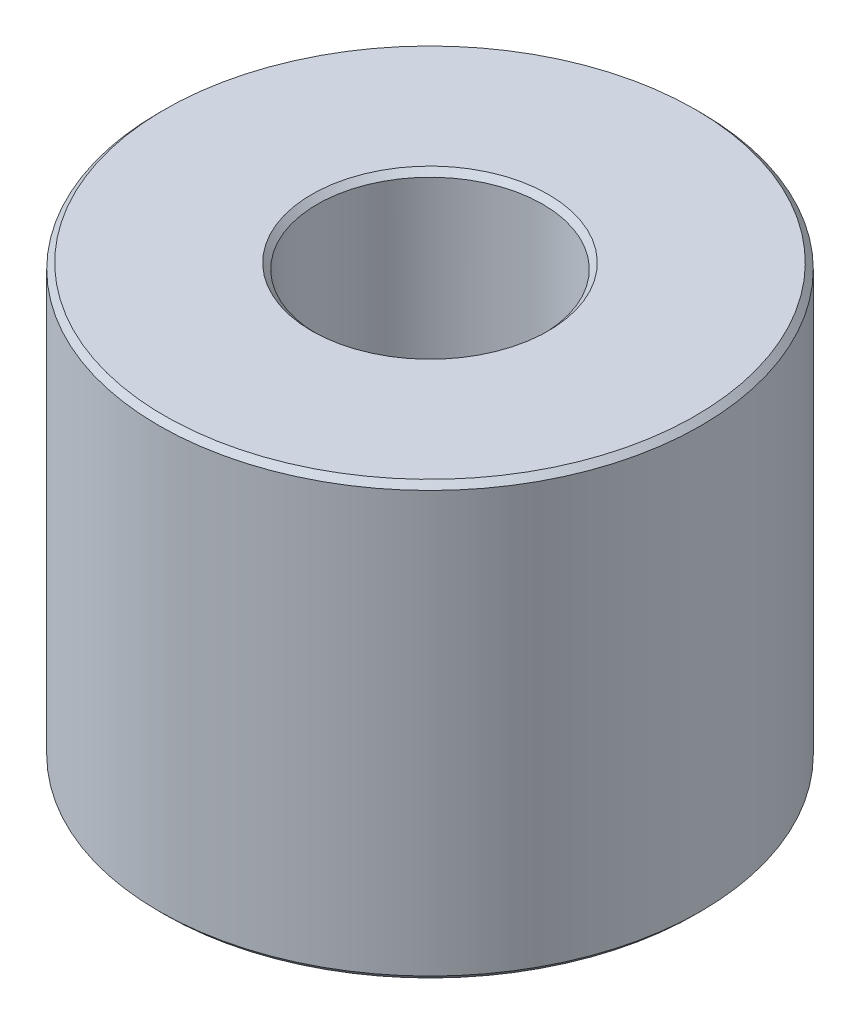
ISO-10303-21;
HEADER;
FILE_DESCRIPTION(('STEP AP214'),'2;1');
FILE_NAME('part.step','',(''),(''),'','','');
FILE_SCHEMA(('AUTOMOTIVE_DESIGN { 1 0 10303 214 1 1 1 1 }'));
ENDSEC;
DATA;
#1=APPLICATION_CONTEXT('core data for automotive mechanical design processes');
#2=APPLICATION_PROTOCOL_DEFINITION('international standard','automotive_design',2000,#1);
#3=PRODUCT_CONTEXT('',#1,'mechanical');
#4=PRODUCT('Part','Part','',(#3));
#5=PRODUCT_RELATED_PRODUCT_CATEGORY('part','',(#4));
#6=PRODUCT_DEFINITION_FORMATION('','',#4);
#7=PRODUCT_DEFINITION_CONTEXT('part definition',#1,'design');
#8=PRODUCT_DEFINITION('design','',#6,#7);
#9=PRODUCT_DEFINITION_SHAPE('','',#8);
#10=(LENGTH_UNIT() NAMED_UNIT(*) SI_UNIT(.MILLI.,.METRE.));
#11=(NAMED_UNIT(*) PLANE_ANGLE_UNIT() SI_UNIT($,.RADIAN.));
#12=(NAMED_UNIT(*) SI_UNIT($,.STERADIAN.) SOLID_ANGLE_UNIT());
#13=UNCERTAINTY_MEASURE_WITH_UNIT(LENGTH_MEASURE(1.E-05),#10,'distance_accuracy_value','');
#14=(GEOMETRIC_REPRESENTATION_CONTEXT(3) GLOBAL_UNCERTAINTY_ASSIGNED_CONTEXT((#13)) GLOBAL_UNIT_ASSIGNED_CONTEXT((#10,
#11,#12)) REPRESENTATION_CONTEXT('',''));
#15=CARTESIAN_POINT('',(0.,0.,0.));
#16=DIRECTION('',(0.,0.,1.));
#17=DIRECTION('',(1.,0.,0.));
#18=AXIS2_PLACEMENT_3D('',#15,#16,#17);
#19=CARTESIAN_POINT('',(0.,71.7030483440527,0.));
#20=DIRECTION('',(0.,-1.,0.));
#21=DIRECTION('',(0.,0.,-1.));
#22=AXIS2_PLACEMENT_3D('',#19,#20,#21);
#23=CYLINDRICAL_SURFACE('',#22,45.);
#24=CARTESIAN_POINT('',(0.,0.938488548072991,0.));
#25=DIRECTION('',(0.,1.,0.));
#26=DIRECTION('',(0.,0.,1.));
#27=AXIS2_PLACEMENT_3D('',#24,#25,#26);
#28=CIRCLE('',#27,45.);
#29=CARTESIAN_POINT('',(0.,0.938488548072991,45.));
#30=VERTEX_POINT('',#29);
#31=EDGE_CURVE('E10',#30,#30,#28,.T.);
#32=ORIENTED_EDGE('',*,*,#31,.T.);
#33=EDGE_LOOP('',(#32));
#34=FACE_BOUND('',#33,.T.);
#35=CARTESIAN_POINT('',(0.,70.7645597959797,0.));
#36=DIRECTION('',(0.,1.,0.));
#37=DIRECTION('',(0.,0.,1.));
#38=AXIS2_PLACEMENT_3D('',#35,#36,#37);
#39=CIRCLE('',#38,45.);
#40=CARTESIAN_POINT('',(0.,70.7645597959797,-45.));
#41=VERTEX_POINT('',#40);
#42=EDGE_CURVE('E50',#41,#41,#39,.F.);
#43=ORIENTED_EDGE('',*,*,#42,.T.);
#44=EDGE_LOOP('',(#43));
#45=FACE_BOUND('',#44,.T.);
#46=ADVANCED_FACE('F39',(#34,#45),#23,.T.);
#47=CARTESIAN_POINT('',(0.,71.7030483440527,0.));
#48=DIRECTION('',(0.,1.,0.));
#49=DIRECTION('',(0.,0.,1.));
#50=AXIS2_PLACEMENT_3D('',#47,#48,#49);
#51=PLANE('',#50);
#52=CARTESIAN_POINT('',(0.,71.7030483440527,0.));
#53=DIRECTION('',(0.,1.,0.));
#54=DIRECTION('',(0.,0.,1.));
#55=AXIS2_PLACEMENT_3D('',#52,#53,#54);
#56=CIRCLE('',#55,19.6437963944167);
#57=CARTESIAN_POINT('',(0.,71.7030483440527,19.6437963944167));
#58=VERTEX_POINT('',#57);
#59=EDGE_CURVE('E58',#58,#58,#56,.F.);
#60=ORIENTED_EDGE('',*,*,#59,.T.);
#61=EDGE_LOOP('',(#60));
#62=FACE_BOUND('',#61,.T.);
#63=CARTESIAN_POINT('',(0.,71.7030483440527,0.));
#64=DIRECTION('',(0.,1.,0.));
#65=DIRECTION('',(0.,0.,1.));
#66=AXIS2_PLACEMENT_3D('',#63,#64,#65);
#67=CIRCLE('',#66,44.061511451927);
#68=CARTESIAN_POINT('',(0.,71.7030483440527,-44.061511451927));
#69=VERTEX_POINT('',#68);
#70=EDGE_CURVE('E61',#69,#69,#67,.T.);
#71=ORIENTED_EDGE('',*,*,#70,.T.);
#72=EDGE_LOOP('',(#71));
#73=FACE_BOUND('',#72,.T.);
#74=ADVANCED_FACE('F88',(#62,#73),#51,.T.);
#75=CARTESIAN_POINT('',(0.,0.,0.));
#76=DIRECTION('',(0.,1.,0.));
#77=DIRECTION('',(0.,0.,1.));
#78=AXIS2_PLACEMENT_3D('',#75,#76,#77);
#79=PLANE('',#78);
#80=CARTESIAN_POINT('',(0.,0.,0.));
#81=DIRECTION('',(0.,1.,0.));
#82=DIRECTION('',(0.,0.,1.));
#83=AXIS2_PLACEMENT_3D('',#80,#81,#82);
#84=CIRCLE('',#83,19.6437963944167);
#85=CARTESIAN_POINT('',(0.,0.,-19.6437963944167));
#86=VERTEX_POINT('',#85);
#87=EDGE_CURVE('E51',#86,#86,#84,.T.);
#88=ORIENTED_EDGE('',*,*,#87,.T.);
#89=EDGE_LOOP('',(#88));
#90=FACE_BOUND('',#89,.T.);
#91=CARTESIAN_POINT('',(0.,0.,0.));
#92=DIRECTION('',(0.,1.,0.));
#93=DIRECTION('',(0.,0.,1.));
#94=AXIS2_PLACEMENT_3D('',#91,#92,#93);
#95=CIRCLE('',#94,44.061511451927);
#96=CARTESIAN_POINT('',(0.,0.,44.061511451927));
#97=VERTEX_POINT('',#96);
#98=EDGE_CURVE('E54',#97,#97,#95,.F.);
#99=ORIENTED_EDGE('',*,*,#98,.T.);
#100=EDGE_LOOP('',(#99));
#101=FACE_BOUND('',#100,.T.);
#102=ADVANCED_FACE('F83',(#90,#101),#79,.F.);
#103=CARTESIAN_POINT('',(0.,71.7030483440527,0.));
#104=DIRECTION('',(0.,-1.,0.));
#105=DIRECTION('',(0.,0.,-1.));
#106=AXIS2_PLACEMENT_3D('',#103,#104,#105);
#107=CYLINDRICAL_SURFACE('',#106,18.7053078463437);
#108=CARTESIAN_POINT('',(0.,70.7645597959796,0.));
#109=DIRECTION('',(0.,1.,0.));
#110=DIRECTION('',(0.,0.,1.));
#111=AXIS2_PLACEMENT_3D('',#108,#109,#110);
#112=CIRCLE('',#111,18.7053078463437);
#113=CARTESIAN_POINT('',(0.,70.7645597959796,18.7053078463437));
#114=VERTEX_POINT('',#113);
#115=EDGE_CURVE('E67',#114,#114,#112,.T.);
#116=ORIENTED_EDGE('',*,*,#115,.T.);
#117=EDGE_LOOP('',(#116));
#118=FACE_BOUND('',#117,.T.);
#119=CARTESIAN_POINT('',(0.,0.938488548073005,0.));
#120=DIRECTION('',(0.,1.,0.));
#121=DIRECTION('',(0.,0.,1.));
#122=AXIS2_PLACEMENT_3D('',#119,#120,#121);
#123=CIRCLE('',#122,18.7053078463437);
#124=CARTESIAN_POINT('',(0.,0.938488548073005,-18.7053078463437));
#125=VERTEX_POINT('',#124);
#126=EDGE_CURVE('E69',#125,#125,#123,.F.);
#127=ORIENTED_EDGE('',*,*,#126,.T.);
#128=EDGE_LOOP('',(#127));
#129=FACE_BOUND('',#128,.T.);
#130=ADVANCED_FACE('F71',(#118,#129),#107,.F.);
#131=CARTESIAN_POINT('',(0.,70.7645597959796,0.));
#132=DIRECTION('',(0.,1.,0.));
#133=DIRECTION('',(0.,0.,1.));
#134=AXIS2_PLACEMENT_3D('',#131,#132,#133);
#135=CONICAL_SURFACE('',#134,18.7053078463437,0.785398163397448);
#136=ORIENTED_EDGE('',*,*,#59,.F.);
#137=EDGE_LOOP('',(#136));
#138=FACE_BOUND('',#137,.T.);
#139=ORIENTED_EDGE('',*,*,#115,.F.);
#140=EDGE_LOOP('',(#139));
#141=FACE_BOUND('',#140,.T.);
#142=ADVANCED_FACE('F77',(#138,#141),#135,.F.);
#143=CARTESIAN_POINT('',(0.,0.,0.));
#144=DIRECTION('',(0.,-1.,0.));
#145=DIRECTION('',(0.,0.,-1.));
#146=AXIS2_PLACEMENT_3D('',#143,#144,#145);
#147=CONICAL_SURFACE('',#146,19.6437963944167,0.785398163397441);
#148=CARTESIAN_POINT('',(0.,0.938488548073005,-18.7053078463437));
#149=CARTESIAN_POINT('',(0.,0.928712625697244,-18.7150837687194));
#150=CARTESIAN_POINT('',(0.,0.918936703321484,-18.7248596910952));
#151=CARTESIAN_POINT('',(0.,0.899384858569963,-18.7444115358467));
#152=CARTESIAN_POINT('',(0.,0.889608936194202,-18.7541874582225));
#153=CARTESIAN_POINT('',(0.,0.870057091442682,-18.773739302974));
#154=CARTESIAN_POINT('',(0.,0.860281169066921,-18.7835152253498));
#155=CARTESIAN_POINT('',(0.,0.8407293243154,-18.8030670701013));
#156=CARTESIAN_POINT('',(0.,0.83095340193964,-18.812842992477));
#157=CARTESIAN_POINT('',(0.,0.811401557188119,-18.8323948372286));
#158=CARTESIAN_POINT('',(0.,0.801625634812358,-18.8421707596043));
#159=CARTESIAN_POINT('',(0.,0.782073790060837,-18.8617226043558));
#160=CARTESIAN_POINT('',(0.,0.772297867685077,-18.8714985267316));
#161=CARTESIAN_POINT('',(0.,0.752746022933556,-18.8910503714831));
#162=CARTESIAN_POINT('',(0.,0.742970100557795,-18.9008262938589));
#163=CARTESIAN_POINT('',(0.,0.723418255806275,-18.9203781386104));
#164=CARTESIAN_POINT('',(0.,0.713642333430514,-18.9301540609862));
#165=CARTESIAN_POINT('',(0.,0.694090488678993,-18.9497059057377));
#166=CARTESIAN_POINT('',(0.,0.684314566303233,-18.9594818281135));
#167=CARTESIAN_POINT('',(0.,0.664762721551712,-18.979033672865));
#168=CARTESIAN_POINT('',(0.,0.654986799175951,-18.9888095952407));
#169=CARTESIAN_POINT('',(0.,0.63543495442443,-19.0083614399922));
#170=CARTESIAN_POINT('',(0.,0.62565903204867,-19.018137362368));
#171=CARTESIAN_POINT('',(0.,0.606107187297149,-19.0376892071195));
#172=CARTESIAN_POINT('',(0.,0.596331264921388,-19.0474651294953));
#173=CARTESIAN_POINT('',(0.,0.576779420169867,-19.0670169742468));
#174=CARTESIAN_POINT('',(0.,0.567003497794107,-19.0767928966226));
#175=CARTESIAN_POINT('',(0.,0.547451653042586,-19.0963447413741));
#176=CARTESIAN_POINT('',(0.,0.537675730666826,-19.1061206637499));
#177=CARTESIAN_POINT('',(0.,0.518123885915305,-19.1256725085014));
#178=CARTESIAN_POINT('',(0.,0.508347963539544,-19.1354484308771));
#179=CARTESIAN_POINT('',(0.,0.488796118788023,-19.1550002756287));
#180=CARTESIAN_POINT('',(0.,0.479020196412263,-19.1647761980044));
#181=CARTESIAN_POINT('',(0.,0.459468351660742,-19.1843280427559));
#182=CARTESIAN_POINT('',(0.,0.449692429284981,-19.1941039651317));
#183=CARTESIAN_POINT('',(0.,0.43014058453346,-19.2136558098832));
#184=CARTESIAN_POINT('',(0.,0.4203646621577,-19.223431732259));
#185=CARTESIAN_POINT('',(0.,0.400812817406179,-19.2429835770105));
#186=CARTESIAN_POINT('',(0.,0.391036895030419,-19.2527594993863));
#187=CARTESIAN_POINT('',(0.,0.371485050278898,-19.2723113441378));
#188=CARTESIAN_POINT('',(0.,0.361709127903137,-19.2820872665135));
#189=CARTESIAN_POINT('',(0.,0.342157283151616,-19.3016391112651));
#190=CARTESIAN_POINT('',(0.,0.332381360775856,-19.3114150336408));
#191=CARTESIAN_POINT('',(0.,0.312829516024335,-19.3309668783923));
#192=CARTESIAN_POINT('',(0.,0.303053593648574,-19.3407428007681));
#193=CARTESIAN_POINT('',(0.,0.283501748897053,-19.3602946455196));
#194=CARTESIAN_POINT('',(0.,0.273725826521293,-19.3700705678954));
#195=CARTESIAN_POINT('',(0.,0.254173981769772,-19.3896224126469));
#196=CARTESIAN_POINT('',(0.,0.244398059394012,-19.3993983350227));
#197=CARTESIAN_POINT('',(0.,0.224846214642491,-19.4189501797742));
#198=CARTESIAN_POINT('',(0.,0.21507029226673,-19.4287261021499));
#199=CARTESIAN_POINT('',(0.,0.195518447515209,-19.4482779469015));
#200=CARTESIAN_POINT('',(0.,0.185742525139449,-19.4580538692772));
#201=CARTESIAN_POINT('',(0.,0.166190680387928,-19.4776057140287));
#202=CARTESIAN_POINT('',(0.,0.156414758012167,-19.4873816364045));
#203=CARTESIAN_POINT('',(0.,0.136862913260647,-19.506933481156));
#204=CARTESIAN_POINT('',(0.,0.127086990884886,-19.5167094035318));
#205=CARTESIAN_POINT('',(0.,0.107535146133365,-19.5362612482833));
#206=CARTESIAN_POINT('',(0.,0.0977592237576047,-19.5460371706591));
#207=CARTESIAN_POINT('',(0.,0.0782073790060837,-19.5655890154106));
#208=CARTESIAN_POINT('',(0.,0.0684314566303233,-19.5753649377864));
#209=CARTESIAN_POINT('',(0.,0.0488796118788023,-19.5949167825379));
#210=CARTESIAN_POINT('',(0.,0.0391036895030419,-19.6046927049136));
#211=CARTESIAN_POINT('',(0.,0.0195518447515209,-19.6242445496651));
#212=CARTESIAN_POINT('',(0.,0.00977592237576046,-19.6340204720409));
#213=CARTESIAN_POINT('',(0.,0.,-19.6437963944167));
#214=B_SPLINE_CURVE_WITH_KNOTS('',3,(#148,#149,#150,#151,#152,#153,#154,#155,#156,#157,#158,
#159,#160,#161,#162,#163,#164,#165,#166,#167,#168,#169,#170,#171,#172,#173,#174,#175,#176,#177,
#178,#179,#180,#181,#182,#183,#184,#185,#186,#187,#188,#189,#190,#191,#192,#193,#194,#195,#196,
#197,#198,#199,#200,#201,#202,#203,#204,#205,#206,#207,#208,#209,#210,#211,#212,#213),
.UNSPECIFIED.,.F.,.F.,(4,2,2,2,2,2,2,2,2,2,2,2,2,2,2,2,2,2,2,2,2,2,2,2,2,2,2,2,2,2,2,2,4),(0.,
0.0414757260255209,0.0829514520510417,0.124427178076563,0.165902904102083,0.207378630127604,
0.248854356153125,0.290330082178646,0.331805808204167,0.373281534229688,0.414757260255209,
0.45623298628073,0.49770871230625,0.539184438331771,0.580660164357292,0.622135890382813,
0.663611616408334,0.705087342433855,0.746563068459376,0.788038794484897,0.829514520510417,
0.870990246535938,0.912465972561459,0.95394169858698,0.995417424612501,1.03689315063802,
1.07836887666354,1.11984460268906,1.16132032871458,1.20279605474011,1.24427178076563,
1.28574750679115,1.32722323281667),.UNSPECIFIED.);
#215=EDGE_CURVE('BSEAM73',#125,#86,#214,.T.);
#216=ORIENTED_EDGE('',*,*,#126,.F.);
#217=ORIENTED_EDGE('',*,*,#87,.F.);
#218=ORIENTED_EDGE('',*,*,#215,.T.);
#219=ORIENTED_EDGE('',*,*,#215,.F.);
#220=EDGE_LOOP('',(#216,#218,#217,#219));
#221=FACE_BOUND('',#220,.T.);
#222=ADVANCED_FACE('F73',(#221),#147,.F.);
#223=CARTESIAN_POINT('',(0.,0.938488548072991,0.));
#224=DIRECTION('',(0.,1.,0.));
#225=DIRECTION('',(0.,0.,1.));
#226=AXIS2_PLACEMENT_3D('',#223,#224,#225);
#227=CONICAL_SURFACE('',#226,45.,0.785398163397456);
#228=ORIENTED_EDGE('',*,*,#98,.F.);
#229=EDGE_LOOP('',(#228));
#230=FACE_BOUND('',#229,.T.);
#231=ORIENTED_EDGE('',*,*,#31,.F.);
#232=EDGE_LOOP('',(#231));
#233=FACE_BOUND('',#232,.T.);
#234=ADVANCED_FACE('F76',(#230,#233),#227,.T.);
#235=CARTESIAN_POINT('',(0.,71.7030483440527,0.));
#236=DIRECTION('',(0.,-1.,0.));
#237=DIRECTION('',(0.,0.,-1.));
#238=AXIS2_PLACEMENT_3D('',#235,#236,#237);
#239=CONICAL_SURFACE('',#238,44.061511451927,0.785398163397445);
#240=CARTESIAN_POINT('',(0.,70.7645597959797,-45.));
#241=CARTESIAN_POINT('',(0.,70.7743357183554,-44.9902240776242));
#242=CARTESIAN_POINT('',(0.,70.7841116407312,-44.9804481552485));
#243=CARTESIAN_POINT('',(0.,70.8036634854827,-44.960896310497));
#244=CARTESIAN_POINT('',(0.,70.8134394078585,-44.9511203881212));
#245=CARTESIAN_POINT('',(0.,70.83299125261,-44.9315685433697));
#246=CARTESIAN_POINT('',(0.,70.8427671749857,-44.9217926209939));
#247=CARTESIAN_POINT('',(0.,70.8623190197373,-44.9022407762424));
#248=CARTESIAN_POINT('',(0.,70.872094942113,-44.8924648538666));
#249=CARTESIAN_POINT('',(0.,70.8916467868646,-44.8729130091151));
#250=CARTESIAN_POINT('',(0.,70.9014227092403,-44.8631370867394));
#251=CARTESIAN_POINT('',(0.,70.9209745539918,-44.8435852419878));
#252=CARTESIAN_POINT('',(0.,70.9307504763676,-44.8338093196121));
#253=CARTESIAN_POINT('',(0.,70.9503023211191,-44.8142574748606));
#254=CARTESIAN_POINT('',(0.,70.9600782434949,-44.8044815524848));
#255=CARTESIAN_POINT('',(0.,70.9796300882464,-44.7849297077333));
#256=CARTESIAN_POINT('',(0.,70.9894060106221,-44.7751537853575));
#257=CARTESIAN_POINT('',(0.,71.0089578553737,-44.755601940606));
#258=CARTESIAN_POINT('',(0.,71.0187337777494,-44.7458260182302));
#259=CARTESIAN_POINT('',(0.,71.038285622501,-44.7262741734787));
#260=CARTESIAN_POINT('',(0.,71.0480615448767,-44.716498251103));
#261=CARTESIAN_POINT('',(0.,71.0676133896282,-44.6969464063514));
#262=CARTESIAN_POINT('',(0.,71.077389312004,-44.6871704839757));
#263=CARTESIAN_POINT('',(0.,71.0969411567555,-44.6676186392242));
#264=CARTESIAN_POINT('',(0.,71.1067170791313,-44.6578427168484));
#265=CARTESIAN_POINT('',(0.,71.1262689238828,-44.6382908720969));
#266=CARTESIAN_POINT('',(0.,71.1360448462585,-44.6285149497211));
#267=CARTESIAN_POINT('',(0.,71.1555966910101,-44.6089631049696));
#268=CARTESIAN_POINT('',(0.,71.1653726133858,-44.5991871825938));
#269=CARTESIAN_POINT('',(0.,71.1849244581374,-44.5796353378423));
#270=CARTESIAN_POINT('',(0.,71.1947003805131,-44.5698594154666));
#271=CARTESIAN_POINT('',(0.,71.2142522252646,-44.550307570715));
#272=CARTESIAN_POINT('',(0.,71.2240281476404,-44.5405316483393));
#273=CARTESIAN_POINT('',(0.,71.2435799923919,-44.5209798035878));
#274=CARTESIAN_POINT('',(0.,71.2533559147677,-44.511203881212));
#275=CARTESIAN_POINT('',(0.,71.2729077595192,-44.4916520364605));
#276=CARTESIAN_POINT('',(0.,71.282683681895,-44.4818761140847));
#277=CARTESIAN_POINT('',(0.,71.3022355266465,-44.4623242693332));
#278=CARTESIAN_POINT('',(0.,71.3120114490223,-44.4525483469574));
#279=CARTESIAN_POINT('',(0.,71.3315632937738,-44.4329965022059));
#280=CARTESIAN_POINT('',(0.,71.3413392161495,-44.4232205798301));
#281=CARTESIAN_POINT('',(0.,71.360891060901,-44.4036687350786));
#282=CARTESIAN_POINT('',(0.,71.3706669832768,-44.3938928127029));
#283=CARTESIAN_POINT('',(0.,71.3902188280283,-44.3743409679513));
#284=CARTESIAN_POINT('',(0.,71.3999947504041,-44.3645650455756));
#285=CARTESIAN_POINT('',(0.,71.4195465951556,-44.3450132008241));
#286=CARTESIAN_POINT('',(0.,71.4293225175314,-44.3352372784483));
#287=CARTESIAN_POINT('',(0.,71.4488743622829,-44.3156854336968));
#288=CARTESIAN_POINT('',(0.,71.4586502846586,-44.305909511321));
#289=CARTESIAN_POINT('',(0.,71.4782021294102,-44.2863576665695));
#290=CARTESIAN_POINT('',(0.,71.4879780517859,-44.2765817441937));
#291=CARTESIAN_POINT('',(0.,71.5075298965374,-44.2570298994422));
#292=CARTESIAN_POINT('',(0.,71.5173058189132,-44.2472539770665));
#293=CARTESIAN_POINT('',(0.,71.5368576636647,-44.2277021323149));
#294=CARTESIAN_POINT('',(0.,71.5466335860405,-44.2179262099392));
#295=CARTESIAN_POINT('',(0.,71.566185430792,-44.1983743651877));
#296=CARTESIAN_POINT('',(0.,71.5759613531678,-44.1885984428119));
#297=CARTESIAN_POINT('',(0.,71.5955131979193,-44.1690465980604));
#298=CARTESIAN_POINT('',(0.,71.6052891202951,-44.1592706756846));
#299=CARTESIAN_POINT('',(0.,71.6248409650466,-44.1397188309331));
#300=CARTESIAN_POINT('',(0.,71.6346168874223,-44.1299429085573));
#301=CARTESIAN_POINT('',(0.,71.6541687321739,-44.1103910638058));
#302=CARTESIAN_POINT('',(0.,71.6639446545496,-44.1006151414301));
#303=CARTESIAN_POINT('',(0.,71.6834964993011,-44.0810632966785));
#304=CARTESIAN_POINT('',(0.,71.6932724216769,-44.0712873743028));
#305=CARTESIAN_POINT('',(0.,71.7030483440527,-44.061511451927));
#306=B_SPLINE_CURVE_WITH_KNOTS('',3,(#240,#241,#242,#243,#244,#245,#246,#247,#248,#249,#250,
#251,#252,#253,#254,#255,#256,#257,#258,#259,#260,#261,#262,#263,#264,#265,#266,#267,#268,#269,
#270,#271,#272,#273,#274,#275,#276,#277,#278,#279,#280,#281,#282,#283,#284,#285,#286,#287,#288,
#289,#290,#291,#292,#293,#294,#295,#296,#297,#298,#299,#300,#301,#302,#303,#304,#305),
.UNSPECIFIED.,.F.,.F.,(4,2,2,2,2,2,2,2,2,2,2,2,2,2,2,2,2,2,2,2,2,2,2,2,2,2,2,2,2,2,2,2,4),(0.,
0.0414757260255157,0.0829514520510411,0.124427178076557,0.165902904102082,0.207378630127598,
0.248854356153123,0.290330082178639,0.331805808204165,0.37328153422968,0.414757260255206,
0.456232986280721,0.497708712306247,0.539184438331763,0.580660164357288,0.622135890382804,
0.663611616408329,0.70508734243386,0.746563068459375,0.788038794484901,0.829514520510417,
0.870990246535942,0.912465972561458,0.953941698586983,0.995417424612499,1.03689315063802,
1.07836887666354,1.11984460268907,1.16132032871458,1.20279605474011,1.24427178076562,
1.28574750679115,1.32722323281667),.UNSPECIFIED.);
#307=EDGE_CURVE('BSEAM45',#41,#69,#306,.T.);
#308=ORIENTED_EDGE('',*,*,#42,.F.);
#309=ORIENTED_EDGE('',*,*,#70,.F.);
#310=ORIENTED_EDGE('',*,*,#307,.T.);
#311=ORIENTED_EDGE('',*,*,#307,.F.);
#312=EDGE_LOOP('',(#308,#310,#309,#311));
#313=FACE_BOUND('',#312,.T.);
#314=ADVANCED_FACE('F45',(#313),#239,.T.);
#315=CLOSED_SHELL('',(#46,#74,#102,#130,#142,#222,#234,#314));
#316=MANIFOLD_SOLID_BREP('B2',#315);
#317=ADVANCED_BREP_SHAPE_REPRESENTATION('',(#18,#316),#14);
#318=SHAPE_DEFINITION_REPRESENTATION(#9,#317);
ENDSEC;
END-ISO-10303-21;
